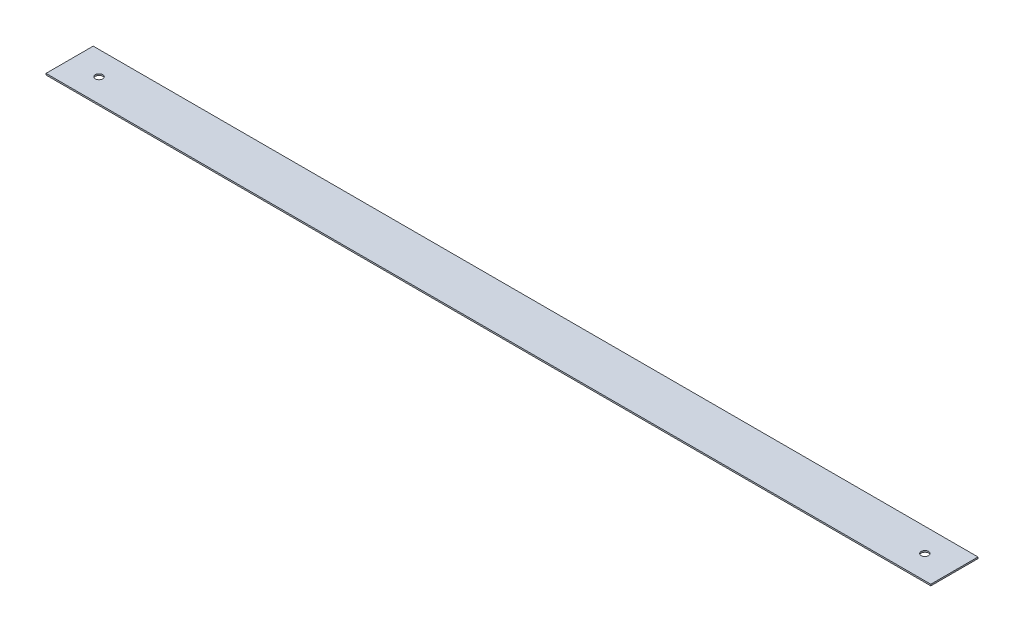
ISO-10303-21;
HEADER;
FILE_DESCRIPTION(('STEP AP214'),'2;1');
FILE_NAME('part.step','',(''),(''),'','','');
FILE_SCHEMA(('AUTOMOTIVE_DESIGN { 1 0 10303 214 1 1 1 1 }'));
ENDSEC;
DATA;
#1=APPLICATION_CONTEXT('core data for automotive mechanical design processes');
#2=APPLICATION_PROTOCOL_DEFINITION('international standard','automotive_design',2000,#1);
#3=PRODUCT_CONTEXT('',#1,'mechanical');
#4=PRODUCT('Part','Part','',(#3));
#5=PRODUCT_RELATED_PRODUCT_CATEGORY('part','',(#4));
#6=PRODUCT_DEFINITION_FORMATION('','',#4);
#7=PRODUCT_DEFINITION_CONTEXT('part definition',#1,'design');
#8=PRODUCT_DEFINITION('design','',#6,#7);
#9=PRODUCT_DEFINITION_SHAPE('','',#8);
#10=(LENGTH_UNIT() NAMED_UNIT(*) SI_UNIT(.MILLI.,.METRE.));
#11=(NAMED_UNIT(*) PLANE_ANGLE_UNIT() SI_UNIT($,.RADIAN.));
#12=(NAMED_UNIT(*) SI_UNIT($,.STERADIAN.) SOLID_ANGLE_UNIT());
#13=UNCERTAINTY_MEASURE_WITH_UNIT(LENGTH_MEASURE(1.E-05),#10,'distance_accuracy_value','');
#14=(GEOMETRIC_REPRESENTATION_CONTEXT(3) GLOBAL_UNCERTAINTY_ASSIGNED_CONTEXT((#13)) GLOBAL_UNIT_ASSIGNED_CONTEXT((#10,
#11,#12)) REPRESENTATION_CONTEXT('',''));
#15=CARTESIAN_POINT('',(0.,0.,0.));
#16=DIRECTION('',(0.,0.,1.));
#17=DIRECTION('',(1.,0.,0.));
#18=AXIS2_PLACEMENT_3D('',#15,#16,#17);
#19=CARTESIAN_POINT('',(0.,12.7,0.));
#20=DIRECTION('',(0.,1.,0.));
#21=DIRECTION('',(0.,0.,1.));
#22=AXIS2_PLACEMENT_3D('',#19,#20,#21);
#23=PLANE('',#22);
#24=CARTESIAN_POINT('',(254.,12.7,203.2));
#25=DIRECTION('',(0.,1.,0.));
#26=DIRECTION('',(0.,0.,1.));
#27=AXIS2_PLACEMENT_3D('',#24,#25,#26);
#28=CIRCLE('',#27,31.75);
#29=CARTESIAN_POINT('',(254.,12.7,234.95));
#30=VERTEX_POINT('',#29);
#31=EDGE_CURVE('E103',#30,#30,#28,.T.);
#32=ORIENTED_EDGE('',*,*,#31,.F.);
#33=EDGE_LOOP('',(#32));
#34=FACE_BOUND('',#33,.T.);
#35=DIRECTION('',(0.,0.,1.));
#36=VECTOR('',#35,1.);
#37=CARTESIAN_POINT('',(0.,12.7,0.));
#38=LINE('',#37,#36);
#39=CARTESIAN_POINT('',(0.,12.7,0.));
#40=VERTEX_POINT('',#39);
#41=CARTESIAN_POINT('',(0.,12.7,406.4));
#42=VERTEX_POINT('',#41);
#43=EDGE_CURVE('E88',#40,#42,#38,.T.);
#44=ORIENTED_EDGE('',*,*,#43,.T.);
#45=DIRECTION('',(1.,0.,0.));
#46=VECTOR('',#45,1.);
#47=CARTESIAN_POINT('',(0.,12.7,406.4));
#48=LINE('',#47,#46);
#49=CARTESIAN_POINT('',(7620.,12.7,406.4));
#50=VERTEX_POINT('',#49);
#51=EDGE_CURVE('E83',#42,#50,#48,.T.);
#52=ORIENTED_EDGE('',*,*,#51,.T.);
#53=DIRECTION('',(0.,0.,-1.));
#54=VECTOR('',#53,1.);
#55=CARTESIAN_POINT('',(7620.,12.7,0.));
#56=LINE('',#55,#54);
#57=CARTESIAN_POINT('',(7620.,12.7,0.));
#58=VERTEX_POINT('',#57);
#59=EDGE_CURVE('E86',#50,#58,#56,.T.);
#60=ORIENTED_EDGE('',*,*,#59,.T.);
#61=DIRECTION('',(-1.,0.,0.));
#62=VECTOR('',#61,1.);
#63=CARTESIAN_POINT('',(0.,12.7,0.));
#64=LINE('',#63,#62);
#65=EDGE_CURVE('E53',#58,#40,#64,.T.);
#66=ORIENTED_EDGE('',*,*,#65,.T.);
#67=EDGE_LOOP('',(#44,#52,#60,#66));
#68=FACE_BOUND('',#67,.T.);
#69=CARTESIAN_POINT('',(7366.,12.7,203.2));
#70=DIRECTION('',(0.,1.,0.));
#71=DIRECTION('',(0.,0.,1.));
#72=AXIS2_PLACEMENT_3D('',#69,#70,#71);
#73=CIRCLE('',#72,31.7499999999999);
#74=CARTESIAN_POINT('',(7366.,12.7,234.95));
#75=VERTEX_POINT('',#74);
#76=EDGE_CURVE('E118',#75,#75,#73,.T.);
#77=ORIENTED_EDGE('',*,*,#76,.F.);
#78=EDGE_LOOP('',(#77));
#79=FACE_BOUND('',#78,.T.);
#80=ADVANCED_FACE('F36',(#34,#68,#79),#23,.T.);
#81=CARTESIAN_POINT('',(0.,0.,0.));
#82=DIRECTION('',(0.,1.,0.));
#83=DIRECTION('',(0.,0.,1.));
#84=AXIS2_PLACEMENT_3D('',#81,#82,#83);
#85=PLANE('',#84);
#86=DIRECTION('',(0.,0.,1.));
#87=VECTOR('',#86,1.);
#88=CARTESIAN_POINT('',(0.,0.,0.));
#89=LINE('',#88,#87);
#90=CARTESIAN_POINT('',(0.,0.,0.));
#91=VERTEX_POINT('',#90);
#92=CARTESIAN_POINT('',(0.,0.,406.4));
#93=VERTEX_POINT('',#92);
#94=EDGE_CURVE('E100',#91,#93,#89,.T.);
#95=ORIENTED_EDGE('',*,*,#94,.F.);
#96=DIRECTION('',(-1.,0.,0.));
#97=VECTOR('',#96,1.);
#98=CARTESIAN_POINT('',(0.,0.,0.));
#99=LINE('',#98,#97);
#100=CARTESIAN_POINT('',(7620.,0.,0.));
#101=VERTEX_POINT('',#100);
#102=EDGE_CURVE('E76',#101,#91,#99,.T.);
#103=ORIENTED_EDGE('',*,*,#102,.F.);
#104=DIRECTION('',(0.,0.,-1.));
#105=VECTOR('',#104,1.);
#106=CARTESIAN_POINT('',(7620.,0.,0.));
#107=LINE('',#106,#105);
#108=CARTESIAN_POINT('',(7620.,0.,406.4));
#109=VERTEX_POINT('',#108);
#110=EDGE_CURVE('E70',#109,#101,#107,.T.);
#111=ORIENTED_EDGE('',*,*,#110,.F.);
#112=DIRECTION('',(1.,0.,0.));
#113=VECTOR('',#112,1.);
#114=CARTESIAN_POINT('',(0.,0.,406.4));
#115=LINE('',#114,#113);
#116=EDGE_CURVE('E92',#93,#109,#115,.T.);
#117=ORIENTED_EDGE('',*,*,#116,.F.);
#118=EDGE_LOOP('',(#95,#103,#111,#117));
#119=FACE_BOUND('',#118,.T.);
#120=CARTESIAN_POINT('',(254.,0.,203.2));
#121=DIRECTION('',(0.,1.,0.));
#122=DIRECTION('',(0.,0.,1.));
#123=AXIS2_PLACEMENT_3D('',#120,#121,#122);
#124=CIRCLE('',#123,31.75);
#125=CARTESIAN_POINT('',(254.,0.,234.95));
#126=VERTEX_POINT('',#125);
#127=EDGE_CURVE('E115',#126,#126,#124,.T.);
#128=ORIENTED_EDGE('',*,*,#127,.T.);
#129=EDGE_LOOP('',(#128));
#130=FACE_BOUND('',#129,.T.);
#131=CARTESIAN_POINT('',(7366.,0.,203.2));
#132=DIRECTION('',(0.,1.,0.));
#133=DIRECTION('',(0.,0.,1.));
#134=AXIS2_PLACEMENT_3D('',#131,#132,#133);
#135=CIRCLE('',#134,31.7499999999999);
#136=CARTESIAN_POINT('',(7366.,0.,234.95));
#137=VERTEX_POINT('',#136);
#138=EDGE_CURVE('E121',#137,#137,#135,.T.);
#139=ORIENTED_EDGE('',*,*,#138,.T.);
#140=EDGE_LOOP('',(#139));
#141=FACE_BOUND('',#140,.T.);
#142=ADVANCED_FACE('F111',(#119,#130,#141),#85,.F.);
#143=CARTESIAN_POINT('',(0.,12.7,0.));
#144=DIRECTION('',(1.,0.,0.));
#145=DIRECTION('',(0.,0.,-1.));
#146=AXIS2_PLACEMENT_3D('',#143,#144,#145);
#147=PLANE('',#146);
#148=ORIENTED_EDGE('',*,*,#94,.T.);
#149=DIRECTION('',(0.,-1.,0.));
#150=VECTOR('',#149,1.);
#151=CARTESIAN_POINT('',(0.,12.7,406.4));
#152=LINE('',#151,#150);
#153=EDGE_CURVE('E11',#42,#93,#152,.T.);
#154=ORIENTED_EDGE('',*,*,#153,.F.);
#155=ORIENTED_EDGE('',*,*,#43,.F.);
#156=DIRECTION('',(0.,-1.,0.));
#157=VECTOR('',#156,1.);
#158=CARTESIAN_POINT('',(0.,12.7,0.));
#159=LINE('',#158,#157);
#160=EDGE_CURVE('E96',#40,#91,#159,.T.);
#161=ORIENTED_EDGE('',*,*,#160,.T.);
#162=EDGE_LOOP('',(#148,#154,#155,#161));
#163=FACE_BOUND('',#162,.T.);
#164=ADVANCED_FACE('F38',(#163),#147,.F.);
#165=CARTESIAN_POINT('',(0.,12.7,406.4));
#166=DIRECTION('',(0.,0.,-1.));
#167=DIRECTION('',(-1.,0.,0.));
#168=AXIS2_PLACEMENT_3D('',#165,#166,#167);
#169=PLANE('',#168);
#170=ORIENTED_EDGE('',*,*,#116,.T.);
#171=DIRECTION('',(0.,-1.,0.));
#172=VECTOR('',#171,1.);
#173=CARTESIAN_POINT('',(7620.,12.7,406.4));
#174=LINE('',#173,#172);
#175=EDGE_CURVE('E45',#50,#109,#174,.T.);
#176=ORIENTED_EDGE('',*,*,#175,.F.);
#177=ORIENTED_EDGE('',*,*,#51,.F.);
#178=ORIENTED_EDGE('',*,*,#153,.T.);
#179=EDGE_LOOP('',(#170,#176,#177,#178));
#180=FACE_BOUND('',#179,.T.);
#181=ADVANCED_FACE('F91',(#180),#169,.F.);
#182=CARTESIAN_POINT('',(7620.,12.7,0.));
#183=DIRECTION('',(-1.,0.,0.));
#184=DIRECTION('',(0.,0.,1.));
#185=AXIS2_PLACEMENT_3D('',#182,#183,#184);
#186=PLANE('',#185);
#187=ORIENTED_EDGE('',*,*,#110,.T.);
#188=DIRECTION('',(0.,-1.,0.));
#189=VECTOR('',#188,1.);
#190=CARTESIAN_POINT('',(7620.,12.7,0.));
#191=LINE('',#190,#189);
#192=EDGE_CURVE('E93',#58,#101,#191,.T.);
#193=ORIENTED_EDGE('',*,*,#192,.F.);
#194=ORIENTED_EDGE('',*,*,#59,.F.);
#195=ORIENTED_EDGE('',*,*,#175,.T.);
#196=EDGE_LOOP('',(#187,#193,#194,#195));
#197=FACE_BOUND('',#196,.T.);
#198=ADVANCED_FACE('F94',(#197),#186,.F.);
#199=CARTESIAN_POINT('',(0.,12.7,0.));
#200=DIRECTION('',(0.,0.,1.));
#201=DIRECTION('',(1.,0.,0.));
#202=AXIS2_PLACEMENT_3D('',#199,#200,#201);
#203=PLANE('',#202);
#204=ORIENTED_EDGE('',*,*,#102,.T.);
#205=ORIENTED_EDGE('',*,*,#160,.F.);
#206=ORIENTED_EDGE('',*,*,#65,.F.);
#207=ORIENTED_EDGE('',*,*,#192,.T.);
#208=EDGE_LOOP('',(#204,#205,#206,#207));
#209=FACE_BOUND('',#208,.T.);
#210=ADVANCED_FACE('F108',(#209),#203,.F.);
#211=CARTESIAN_POINT('',(254.,12.7,203.2));
#212=DIRECTION('',(0.,-1.,0.));
#213=DIRECTION('',(0.,0.,-1.));
#214=AXIS2_PLACEMENT_3D('',#211,#212,#213);
#215=CYLINDRICAL_SURFACE('',#214,31.75);
#216=ORIENTED_EDGE('',*,*,#31,.T.);
#217=EDGE_LOOP('',(#216));
#218=FACE_BOUND('',#217,.T.);
#219=ORIENTED_EDGE('',*,*,#127,.F.);
#220=EDGE_LOOP('',(#219));
#221=FACE_BOUND('',#220,.T.);
#222=ADVANCED_FACE('F138',(#218,#221),#215,.F.);
#223=CARTESIAN_POINT('',(7366.,12.7,203.2));
#224=DIRECTION('',(0.,-1.,0.));
#225=DIRECTION('',(0.,0.,-1.));
#226=AXIS2_PLACEMENT_3D('',#223,#224,#225);
#227=CYLINDRICAL_SURFACE('',#226,31.7499999999999);
#228=ORIENTED_EDGE('',*,*,#76,.T.);
#229=EDGE_LOOP('',(#228));
#230=FACE_BOUND('',#229,.T.);
#231=ORIENTED_EDGE('',*,*,#138,.F.);
#232=EDGE_LOOP('',(#231));
#233=FACE_BOUND('',#232,.T.);
#234=ADVANCED_FACE('F127',(#230,#233),#227,.F.);
#235=CLOSED_SHELL('',(#80,#142,#164,#181,#198,#210,#222,#234));
#236=MANIFOLD_SOLID_BREP('B2',#235);
#237=ADVANCED_BREP_SHAPE_REPRESENTATION('',(#18,#236),#14);
#238=SHAPE_DEFINITION_REPRESENTATION(#9,#237);
ENDSEC;
END-ISO-10303-21;
